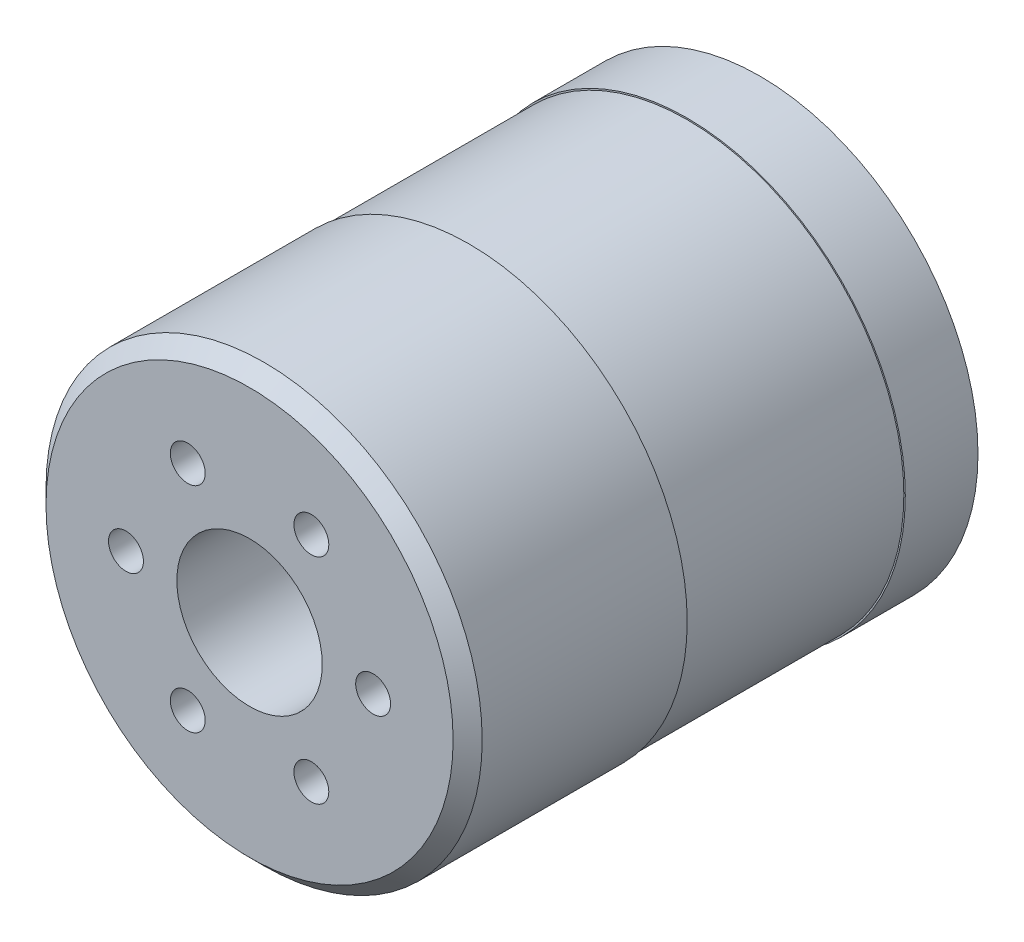
ISO-10303-21;
HEADER;
FILE_DESCRIPTION(('STEP AP214'),'2;1');
FILE_NAME('part.step','',(''),(''),'','','');
FILE_SCHEMA(('AUTOMOTIVE_DESIGN { 1 0 10303 214 1 1 1 1 }'));
ENDSEC;
DATA;
#1=APPLICATION_CONTEXT('core data for automotive mechanical design processes');
#2=APPLICATION_PROTOCOL_DEFINITION('international standard','automotive_design',2000,#1);
#3=PRODUCT_CONTEXT('',#1,'mechanical');
#4=PRODUCT('Part','Part','',(#3));
#5=PRODUCT_RELATED_PRODUCT_CATEGORY('part','',(#4));
#6=PRODUCT_DEFINITION_FORMATION('','',#4);
#7=PRODUCT_DEFINITION_CONTEXT('part definition',#1,'design');
#8=PRODUCT_DEFINITION('design','',#6,#7);
#9=PRODUCT_DEFINITION_SHAPE('','',#8);
#10=(LENGTH_UNIT() NAMED_UNIT(*) SI_UNIT(.MILLI.,.METRE.));
#11=(NAMED_UNIT(*) PLANE_ANGLE_UNIT() SI_UNIT($,.RADIAN.));
#12=(NAMED_UNIT(*) SI_UNIT($,.STERADIAN.) SOLID_ANGLE_UNIT());
#13=UNCERTAINTY_MEASURE_WITH_UNIT(LENGTH_MEASURE(1.E-05),#10,'distance_accuracy_value','');
#14=(GEOMETRIC_REPRESENTATION_CONTEXT(3) GLOBAL_UNCERTAINTY_ASSIGNED_CONTEXT((#13)) GLOBAL_UNIT_ASSIGNED_CONTEXT((#10,
#11,#12)) REPRESENTATION_CONTEXT('',''));
#15=CARTESIAN_POINT('',(0.,0.,0.));
#16=DIRECTION('',(0.,0.,1.));
#17=DIRECTION('',(1.,0.,0.));
#18=AXIS2_PLACEMENT_3D('',#15,#16,#17);
#19=CARTESIAN_POINT('',(0.,0.,0.));
#20=DIRECTION('',(0.,0.,1.));
#21=DIRECTION('',(1.,0.,0.));
#22=AXIS2_PLACEMENT_3D('',#19,#20,#21);
#23=PLANE('',#22);
#24=CARTESIAN_POINT('',(-13.,0.,0.));
#25=DIRECTION('',(0.,0.,-1.));
#26=DIRECTION('',(-1.,0.,0.));
#27=AXIS2_PLACEMENT_3D('',#24,#25,#26);
#28=CIRCLE('',#27,1.25);
#29=CARTESIAN_POINT('',(-14.25,0.,0.));
#30=VERTEX_POINT('',#29);
#31=EDGE_CURVE('E133',#30,#30,#28,.T.);
#32=ORIENTED_EDGE('',*,*,#31,.F.);
#33=EDGE_LOOP('',(#32));
#34=FACE_BOUND('',#33,.T.);
#35=CARTESIAN_POINT('',(0.,13.,0.));
#36=DIRECTION('',(0.,0.,-1.));
#37=DIRECTION('',(-1.,0.,0.));
#38=AXIS2_PLACEMENT_3D('',#35,#36,#37);
#39=CIRCLE('',#38,1.25);
#40=CARTESIAN_POINT('',(-1.25,13.,0.));
#41=VERTEX_POINT('',#40);
#42=EDGE_CURVE('E139',#41,#41,#39,.T.);
#43=ORIENTED_EDGE('',*,*,#42,.F.);
#44=EDGE_LOOP('',(#43));
#45=FACE_BOUND('',#44,.T.);
#46=CARTESIAN_POINT('',(13.,0.,0.));
#47=DIRECTION('',(0.,0.,-1.));
#48=DIRECTION('',(-1.,0.,0.));
#49=AXIS2_PLACEMENT_3D('',#46,#47,#48);
#50=CIRCLE('',#49,1.25);
#51=CARTESIAN_POINT('',(11.75,0.,0.));
#52=VERTEX_POINT('',#51);
#53=EDGE_CURVE('E145',#52,#52,#50,.T.);
#54=ORIENTED_EDGE('',*,*,#53,.F.);
#55=EDGE_LOOP('',(#54));
#56=FACE_BOUND('',#55,.T.);
#57=CARTESIAN_POINT('',(0.,-13.,0.));
#58=DIRECTION('',(0.,0.,-1.));
#59=DIRECTION('',(-1.,0.,0.));
#60=AXIS2_PLACEMENT_3D('',#57,#58,#59);
#61=CIRCLE('',#60,1.25);
#62=CARTESIAN_POINT('',(-1.25,-13.,0.));
#63=VERTEX_POINT('',#62);
#64=EDGE_CURVE('E151',#63,#63,#61,.T.);
#65=ORIENTED_EDGE('',*,*,#64,.F.);
#66=EDGE_LOOP('',(#65));
#67=FACE_BOUND('',#66,.T.);
#68=CARTESIAN_POINT('',(0.,0.,0.));
#69=DIRECTION('',(0.,0.,1.));
#70=DIRECTION('',(1.,0.,0.));
#71=AXIS2_PLACEMENT_3D('',#68,#69,#70);
#72=CIRCLE('',#71,9.);
#73=CARTESIAN_POINT('',(9.,0.,0.));
#74=VERTEX_POINT('',#73);
#75=EDGE_CURVE('E181',#74,#74,#72,.F.);
#76=ORIENTED_EDGE('',*,*,#75,.F.);
#77=EDGE_LOOP('',(#76));
#78=FACE_BOUND('',#77,.T.);
#79=CARTESIAN_POINT('',(0.,0.,0.));
#80=DIRECTION('',(0.,0.,-1.));
#81=DIRECTION('',(-1.,0.,0.));
#82=AXIS2_PLACEMENT_3D('',#79,#80,#81);
#83=CIRCLE('',#82,15.);
#84=CARTESIAN_POINT('',(-15.,0.,0.));
#85=VERTEX_POINT('',#84);
#86=EDGE_CURVE('E154',#85,#85,#83,.T.);
#87=ORIENTED_EDGE('',*,*,#86,.T.);
#88=EDGE_LOOP('',(#87));
#89=FACE_BOUND('',#88,.T.);
#90=ADVANCED_FACE('F39',(#34,#45,#56,#67,#78,#89),#23,.F.);
#91=CARTESIAN_POINT('',(0.,0.,-4.5));
#92=DIRECTION('',(0.,0.,-1.));
#93=DIRECTION('',(-1.,0.,0.));
#94=AXIS2_PLACEMENT_3D('',#91,#92,#93);
#95=PLANE('',#94);
#96=CARTESIAN_POINT('',(0.,0.,-4.5));
#97=DIRECTION('',(0.,0.,-1.));
#98=DIRECTION('',(-1.,0.,0.));
#99=AXIS2_PLACEMENT_3D('',#96,#97,#98);
#100=CIRCLE('',#99,5.);
#101=CARTESIAN_POINT('',(-5.,0.,-4.5));
#102=VERTEX_POINT('',#101);
#103=EDGE_CURVE('E173',#102,#102,#100,.T.);
#104=ORIENTED_EDGE('',*,*,#103,.T.);
#105=EDGE_LOOP('',(#104));
#106=FACE_BOUND('',#105,.T.);
#107=CARTESIAN_POINT('',(0.,0.,-4.5));
#108=DIRECTION('',(0.,0.,-1.));
#109=DIRECTION('',(-1.,0.,0.));
#110=AXIS2_PLACEMENT_3D('',#107,#108,#109);
#111=CIRCLE('',#110,4.);
#112=CARTESIAN_POINT('',(-4.,0.,-4.5));
#113=VERTEX_POINT('',#112);
#114=EDGE_CURVE('E169',#113,#113,#111,.T.);
#115=ORIENTED_EDGE('',*,*,#114,.F.);
#116=EDGE_LOOP('',(#115));
#117=FACE_BOUND('',#116,.T.);
#118=ADVANCED_FACE('F203',(#106,#117),#95,.T.);
#119=CARTESIAN_POINT('',(0.,0.,-4.));
#120=DIRECTION('',(0.,0.,-1.));
#121=DIRECTION('',(-1.,0.,0.));
#122=AXIS2_PLACEMENT_3D('',#119,#120,#121);
#123=PLANE('',#122);
#124=CARTESIAN_POINT('',(0.,0.,-4.));
#125=DIRECTION('',(0.,0.,-1.));
#126=DIRECTION('',(-1.,0.,0.));
#127=AXIS2_PLACEMENT_3D('',#124,#125,#126);
#128=CIRCLE('',#127,9.);
#129=CARTESIAN_POINT('',(-9.,0.,-4.));
#130=VERTEX_POINT('',#129);
#131=EDGE_CURVE('E176',#130,#130,#128,.T.);
#132=ORIENTED_EDGE('',*,*,#131,.T.);
#133=EDGE_LOOP('',(#132));
#134=FACE_BOUND('',#133,.T.);
#135=CARTESIAN_POINT('',(0.,0.,-4.));
#136=DIRECTION('',(0.,0.,-1.));
#137=DIRECTION('',(-1.,0.,0.));
#138=AXIS2_PLACEMENT_3D('',#135,#136,#137);
#139=CIRCLE('',#138,5.);
#140=CARTESIAN_POINT('',(-5.,0.,-4.));
#141=VERTEX_POINT('',#140);
#142=EDGE_CURVE('E172',#141,#141,#139,.T.);
#143=ORIENTED_EDGE('',*,*,#142,.F.);
#144=EDGE_LOOP('',(#143));
#145=FACE_BOUND('',#144,.T.);
#146=ADVANCED_FACE('F209',(#134,#145),#123,.T.);
#147=CARTESIAN_POINT('',(0.,0.,-4.));
#148=DIRECTION('',(0.,0.,1.));
#149=DIRECTION('',(1.,0.,0.));
#150=AXIS2_PLACEMENT_3D('',#147,#148,#149);
#151=CYLINDRICAL_SURFACE('',#150,9.);
#152=ORIENTED_EDGE('',*,*,#131,.F.);
#153=EDGE_LOOP('',(#152));
#154=FACE_BOUND('',#153,.T.);
#155=ORIENTED_EDGE('',*,*,#75,.T.);
#156=EDGE_LOOP('',(#155));
#157=FACE_BOUND('',#156,.T.);
#158=ADVANCED_FACE('F215',(#154,#157),#151,.T.);
#159=CARTESIAN_POINT('',(0.,0.,-4.5));
#160=DIRECTION('',(0.,0.,1.));
#161=DIRECTION('',(1.,0.,0.));
#162=AXIS2_PLACEMENT_3D('',#159,#160,#161);
#163=CYLINDRICAL_SURFACE('',#162,5.);
#164=ORIENTED_EDGE('',*,*,#103,.F.);
#165=EDGE_LOOP('',(#164));
#166=FACE_BOUND('',#165,.T.);
#167=ORIENTED_EDGE('',*,*,#142,.T.);
#168=EDGE_LOOP('',(#167));
#169=FACE_BOUND('',#168,.T.);
#170=ADVANCED_FACE('F218',(#166,#169),#163,.T.);
#171=CARTESIAN_POINT('',(0.,0.,-4.501));
#172=DIRECTION('',(0.,0.,1.));
#173=DIRECTION('',(1.,0.,0.));
#174=AXIS2_PLACEMENT_3D('',#171,#172,#173);
#175=CYLINDRICAL_SURFACE('',#174,4.);
#176=ORIENTED_EDGE('',*,*,#114,.T.);
#177=EDGE_LOOP('',(#176));
#178=FACE_BOUND('',#177,.T.);
#179=CARTESIAN_POINT('',(0.,0.,0.));
#180=DIRECTION('',(0.,0.,-1.));
#181=DIRECTION('',(-1.,0.,0.));
#182=AXIS2_PLACEMENT_3D('',#179,#180,#181);
#183=CIRCLE('',#182,4.);
#184=CARTESIAN_POINT('',(-4.,0.,0.));
#185=VERTEX_POINT('',#184);
#186=EDGE_CURVE('E166',#185,#185,#183,.T.);
#187=ORIENTED_EDGE('',*,*,#186,.F.);
#188=EDGE_LOOP('',(#187));
#189=FACE_BOUND('',#188,.T.);
#190=ADVANCED_FACE('F224',(#178,#189),#175,.F.);
#191=CARTESIAN_POINT('',(0.,0.,0.));
#192=DIRECTION('',(0.,0.,-1.));
#193=DIRECTION('',(-1.,0.,0.));
#194=AXIS2_PLACEMENT_3D('',#191,#192,#193);
#195=PLANE('',#194);
#196=ORIENTED_EDGE('',*,*,#186,.T.);
#197=EDGE_LOOP('',(#196));
#198=FACE_BOUND('',#197,.T.);
#199=ADVANCED_FACE('F229',(#198),#195,.T.);
#200=CARTESIAN_POINT('',(0.,0.,5.));
#201=DIRECTION('',(0.,0.,-1.));
#202=DIRECTION('',(-1.,0.,0.));
#203=AXIS2_PLACEMENT_3D('',#200,#201,#202);
#204=CYLINDRICAL_SURFACE('',#203,15.);
#205=CARTESIAN_POINT('',(0.,0.,5.));
#206=DIRECTION('',(0.,0.,-1.));
#207=DIRECTION('',(-1.,0.,0.));
#208=AXIS2_PLACEMENT_3D('',#205,#206,#207);
#209=CIRCLE('',#208,15.);
#210=CARTESIAN_POINT('',(-15.,0.,5.));
#211=VERTEX_POINT('',#210);
#212=EDGE_CURVE('E155',#211,#211,#209,.T.);
#213=ORIENTED_EDGE('',*,*,#212,.T.);
#214=EDGE_LOOP('',(#213));
#215=FACE_BOUND('',#214,.T.);
#216=ORIENTED_EDGE('',*,*,#86,.F.);
#217=EDGE_LOOP('',(#216));
#218=FACE_BOUND('',#217,.T.);
#219=ADVANCED_FACE('F233',(#215,#218),#204,.T.);
#220=CARTESIAN_POINT('',(0.,0.,5.));
#221=DIRECTION('',(0.,0.,-1.));
#222=DIRECTION('',(-1.,0.,0.));
#223=AXIS2_PLACEMENT_3D('',#220,#221,#222);
#224=PLANE('',#223);
#225=CARTESIAN_POINT('',(0.,0.,5.));
#226=DIRECTION('',(0.,0.,-1.));
#227=DIRECTION('',(-1.,0.,0.));
#228=AXIS2_PLACEMENT_3D('',#225,#226,#227);
#229=CIRCLE('',#228,14.9);
#230=CARTESIAN_POINT('',(-14.9,0.,5.));
#231=VERTEX_POINT('',#230);
#232=EDGE_CURVE('E43',#231,#231,#229,.F.);
#233=ORIENTED_EDGE('',*,*,#232,.F.);
#234=EDGE_LOOP('',(#233));
#235=FACE_BOUND('',#234,.T.);
#236=ORIENTED_EDGE('',*,*,#212,.F.);
#237=EDGE_LOOP('',(#236));
#238=FACE_BOUND('',#237,.T.);
#239=ADVANCED_FACE('F198',(#235,#238),#224,.F.);
#240=CARTESIAN_POINT('',(0.,0.,35.1));
#241=DIRECTION('',(0.,0.,1.));
#242=DIRECTION('',(1.,0.,0.));
#243=AXIS2_PLACEMENT_3D('',#240,#241,#242);
#244=PLANE('',#243);
#245=CARTESIAN_POINT('',(4.25000000000004,-7.36121593216771,35.1));
#246=DIRECTION('',(0.,0.,1.));
#247=DIRECTION('',(1.,0.,0.));
#248=AXIS2_PLACEMENT_3D('',#245,#246,#247);
#249=CIRCLE('',#248,1.19999999999999);
#250=CARTESIAN_POINT('',(5.45000000000003,-7.36121593216771,35.1));
#251=VERTEX_POINT('',#250);
#252=EDGE_CURVE('E90',#251,#251,#249,.T.);
#253=ORIENTED_EDGE('',*,*,#252,.F.);
#254=EDGE_LOOP('',(#253));
#255=FACE_BOUND('',#254,.T.);
#256=CARTESIAN_POINT('',(-4.24999999999998,-7.36121593216774,35.1));
#257=DIRECTION('',(0.,0.,1.));
#258=DIRECTION('',(1.,0.,0.));
#259=AXIS2_PLACEMENT_3D('',#256,#257,#258);
#260=CIRCLE('',#259,1.19999999999999);
#261=CARTESIAN_POINT('',(-3.04999999999999,-7.36121593216774,35.1));
#262=VERTEX_POINT('',#261);
#263=EDGE_CURVE('E89',#262,#262,#260,.T.);
#264=ORIENTED_EDGE('',*,*,#263,.F.);
#265=EDGE_LOOP('',(#264));
#266=FACE_BOUND('',#265,.T.);
#267=CARTESIAN_POINT('',(-8.5,0.,35.1));
#268=DIRECTION('',(0.,0.,1.));
#269=DIRECTION('',(1.,0.,0.));
#270=AXIS2_PLACEMENT_3D('',#267,#268,#269);
#271=CIRCLE('',#270,1.19999999999999);
#272=CARTESIAN_POINT('',(-7.30000000000001,0.,35.1));
#273=VERTEX_POINT('',#272);
#274=EDGE_CURVE('E100',#273,#273,#271,.T.);
#275=ORIENTED_EDGE('',*,*,#274,.F.);
#276=EDGE_LOOP('',(#275));
#277=FACE_BOUND('',#276,.T.);
#278=CARTESIAN_POINT('',(-4.25000000000004,7.36121593216771,35.1));
#279=DIRECTION('',(0.,0.,1.));
#280=DIRECTION('',(1.,0.,0.));
#281=AXIS2_PLACEMENT_3D('',#278,#279,#280);
#282=CIRCLE('',#281,1.19999999999999);
#283=CARTESIAN_POINT('',(-3.05000000000005,7.36121593216771,35.1));
#284=VERTEX_POINT('',#283);
#285=EDGE_CURVE('E106',#284,#284,#282,.T.);
#286=ORIENTED_EDGE('',*,*,#285,.F.);
#287=EDGE_LOOP('',(#286));
#288=FACE_BOUND('',#287,.T.);
#289=CARTESIAN_POINT('',(4.24999999999998,7.36121593216774,35.1));
#290=DIRECTION('',(0.,0.,1.));
#291=DIRECTION('',(1.,0.,0.));
#292=AXIS2_PLACEMENT_3D('',#289,#290,#291);
#293=CIRCLE('',#292,1.19999999999999);
#294=CARTESIAN_POINT('',(5.44999999999997,7.36121593216774,35.1));
#295=VERTEX_POINT('',#294);
#296=EDGE_CURVE('E112',#295,#295,#293,.T.);
#297=ORIENTED_EDGE('',*,*,#296,.F.);
#298=EDGE_LOOP('',(#297));
#299=FACE_BOUND('',#298,.T.);
#300=CARTESIAN_POINT('',(8.5,0.,35.1));
#301=DIRECTION('',(0.,0.,1.));
#302=DIRECTION('',(1.,0.,0.));
#303=AXIS2_PLACEMENT_3D('',#300,#301,#302);
#304=CIRCLE('',#303,1.19999999999999);
#305=CARTESIAN_POINT('',(9.69999999999999,0.,35.1));
#306=VERTEX_POINT('',#305);
#307=EDGE_CURVE('E118',#306,#306,#304,.T.);
#308=ORIENTED_EDGE('',*,*,#307,.F.);
#309=EDGE_LOOP('',(#308));
#310=FACE_BOUND('',#309,.T.);
#311=CARTESIAN_POINT('',(0.,0.,35.1));
#312=DIRECTION('',(0.,0.,1.));
#313=DIRECTION('',(1.,0.,0.));
#314=AXIS2_PLACEMENT_3D('',#311,#312,#313);
#315=CIRCLE('',#314,5.);
#316=CARTESIAN_POINT('',(5.,0.,35.1));
#317=VERTEX_POINT('',#316);
#318=EDGE_CURVE('E124',#317,#317,#315,.T.);
#319=ORIENTED_EDGE('',*,*,#318,.F.);
#320=EDGE_LOOP('',(#319));
#321=FACE_BOUND('',#320,.T.);
#322=CARTESIAN_POINT('',(0.,0.,35.1));
#323=DIRECTION('',(0.,0.,1.));
#324=DIRECTION('',(1.,0.,0.));
#325=AXIS2_PLACEMENT_3D('',#322,#323,#324);
#326=CIRCLE('',#325,14.);
#327=CARTESIAN_POINT('',(14.,0.,35.1));
#328=VERTEX_POINT('',#327);
#329=EDGE_CURVE('E48',#328,#328,#326,.T.);
#330=ORIENTED_EDGE('',*,*,#329,.T.);
#331=EDGE_LOOP('',(#330));
#332=FACE_BOUND('',#331,.T.);
#333=ADVANCED_FACE('F187',(#255,#266,#277,#288,#299,#310,#321,#332),#244,.T.);
#334=CARTESIAN_POINT('',(0.,0.,35.1));
#335=DIRECTION('',(0.,0.,-1.));
#336=DIRECTION('',(-1.,0.,0.));
#337=AXIS2_PLACEMENT_3D('',#334,#335,#336);
#338=CONICAL_SURFACE('',#337,14.,0.785398163397446);
#339=CARTESIAN_POINT('',(0.,0.,34.1));
#340=DIRECTION('',(0.,0.,1.));
#341=DIRECTION('',(1.,0.,0.));
#342=AXIS2_PLACEMENT_3D('',#339,#340,#341);
#343=CIRCLE('',#342,15.);
#344=CARTESIAN_POINT('',(15.,0.,34.1));
#345=VERTEX_POINT('',#344);
#346=EDGE_CURVE('E11',#345,#345,#343,.F.);
#347=ORIENTED_EDGE('',*,*,#346,.F.);
#348=EDGE_LOOP('',(#347));
#349=FACE_BOUND('',#348,.T.);
#350=ORIENTED_EDGE('',*,*,#329,.F.);
#351=EDGE_LOOP('',(#350));
#352=FACE_BOUND('',#351,.T.);
#353=ADVANCED_FACE('F41',(#349,#352),#338,.T.);
#354=CARTESIAN_POINT('',(0.,0.,35.1));
#355=DIRECTION('',(0.,0.,-1.));
#356=DIRECTION('',(-1.,0.,0.));
#357=AXIS2_PLACEMENT_3D('',#354,#355,#356);
#358=CYLINDRICAL_SURFACE('',#357,15.);
#359=ORIENTED_EDGE('',*,*,#346,.T.);
#360=EDGE_LOOP('',(#359));
#361=FACE_BOUND('',#360,.T.);
#362=CARTESIAN_POINT('',(0.,0.,20.));
#363=DIRECTION('',(0.,0.,-1.));
#364=DIRECTION('',(-1.,0.,0.));
#365=AXIS2_PLACEMENT_3D('',#362,#363,#364);
#366=CIRCLE('',#365,15.);
#367=CARTESIAN_POINT('',(-15.,0.,20.));
#368=VERTEX_POINT('',#367);
#369=EDGE_CURVE('E163',#368,#368,#366,.T.);
#370=ORIENTED_EDGE('',*,*,#369,.F.);
#371=EDGE_LOOP('',(#370));
#372=FACE_BOUND('',#371,.T.);
#373=ADVANCED_FACE('F190',(#361,#372),#358,.T.);
#374=CARTESIAN_POINT('',(0.,0.,20.));
#375=DIRECTION('',(0.,0.,-1.));
#376=DIRECTION('',(-1.,0.,0.));
#377=AXIS2_PLACEMENT_3D('',#374,#375,#376);
#378=PLANE('',#377);
#379=CARTESIAN_POINT('',(0.,0.,20.));
#380=DIRECTION('',(0.,0.,-1.));
#381=DIRECTION('',(-1.,0.,0.));
#382=AXIS2_PLACEMENT_3D('',#379,#380,#381);
#383=CIRCLE('',#382,14.9);
#384=CARTESIAN_POINT('',(-14.9,0.,20.));
#385=VERTEX_POINT('',#384);
#386=EDGE_CURVE('E160',#385,#385,#383,.T.);
#387=ORIENTED_EDGE('',*,*,#386,.F.);
#388=EDGE_LOOP('',(#387));
#389=FACE_BOUND('',#388,.T.);
#390=ORIENTED_EDGE('',*,*,#369,.T.);
#391=EDGE_LOOP('',(#390));
#392=FACE_BOUND('',#391,.T.);
#393=ADVANCED_FACE('F196',(#389,#392),#378,.T.);
#394=CARTESIAN_POINT('',(0.,0.,20.));
#395=DIRECTION('',(0.,0.,-1.));
#396=DIRECTION('',(-1.,0.,0.));
#397=AXIS2_PLACEMENT_3D('',#394,#395,#396);
#398=CYLINDRICAL_SURFACE('',#397,14.9);
#399=ORIENTED_EDGE('',*,*,#386,.T.);
#400=EDGE_LOOP('',(#399));
#401=FACE_BOUND('',#400,.T.);
#402=ORIENTED_EDGE('',*,*,#232,.T.);
#403=EDGE_LOOP('',(#402));
#404=FACE_BOUND('',#403,.T.);
#405=ADVANCED_FACE('F237',(#401,#404),#398,.T.);
#406=CARTESIAN_POINT('',(0.,-13.,0.));
#407=DIRECTION('',(0.,0.,-1.));
#408=DIRECTION('',(-1.,0.,0.));
#409=AXIS2_PLACEMENT_3D('',#406,#407,#408);
#410=CYLINDRICAL_SURFACE('',#409,1.25);
#411=CARTESIAN_POINT('',(0.,-13.,4.5));
#412=DIRECTION('',(0.,0.,-1.));
#413=DIRECTION('',(-1.,0.,0.));
#414=AXIS2_PLACEMENT_3D('',#411,#412,#413);
#415=CIRCLE('',#414,1.25);
#416=CARTESIAN_POINT('',(-1.25,-13.,4.5));
#417=VERTEX_POINT('',#416);
#418=EDGE_CURVE('E148',#417,#417,#415,.T.);
#419=ORIENTED_EDGE('',*,*,#418,.F.);
#420=EDGE_LOOP('',(#419));
#421=FACE_BOUND('',#420,.T.);
#422=ORIENTED_EDGE('',*,*,#64,.T.);
#423=EDGE_LOOP('',(#422));
#424=FACE_BOUND('',#423,.T.);
#425=ADVANCED_FACE('F241',(#421,#424),#410,.F.);
#426=CARTESIAN_POINT('',(0.,-13.,4.5));
#427=DIRECTION('',(0.,0.,-1.));
#428=DIRECTION('',(-1.,0.,0.));
#429=AXIS2_PLACEMENT_3D('',#426,#427,#428);
#430=CONICAL_SURFACE('',#429,1.25,1.02974425867665);
#431=CARTESIAN_POINT('',(0.,-13.,5.25107577378445));
#432=VERTEX_POINT('',#431);
#433=VERTEX_LOOP('',#432);
#434=FACE_BOUND('',#433,.T.);
#435=ORIENTED_EDGE('',*,*,#418,.T.);
#436=EDGE_LOOP('',(#435));
#437=FACE_BOUND('',#436,.T.);
#438=ADVANCED_FACE('F251',(#434,#437),#430,.F.);
#439=CARTESIAN_POINT('',(13.,0.,0.));
#440=DIRECTION('',(0.,0.,-1.));
#441=DIRECTION('',(-1.,0.,0.));
#442=AXIS2_PLACEMENT_3D('',#439,#440,#441);
#443=CYLINDRICAL_SURFACE('',#442,1.25);
#444=CARTESIAN_POINT('',(13.,0.,4.5));
#445=DIRECTION('',(0.,0.,-1.));
#446=DIRECTION('',(-1.,0.,0.));
#447=AXIS2_PLACEMENT_3D('',#444,#445,#446);
#448=CIRCLE('',#447,1.25);
#449=CARTESIAN_POINT('',(11.75,0.,4.5));
#450=VERTEX_POINT('',#449);
#451=EDGE_CURVE('E142',#450,#450,#448,.T.);
#452=ORIENTED_EDGE('',*,*,#451,.F.);
#453=EDGE_LOOP('',(#452));
#454=FACE_BOUND('',#453,.T.);
#455=ORIENTED_EDGE('',*,*,#53,.T.);
#456=EDGE_LOOP('',(#455));
#457=FACE_BOUND('',#456,.T.);
#458=ADVANCED_FACE('F255',(#454,#457),#443,.F.);
#459=CARTESIAN_POINT('',(13.,0.,4.5));
#460=DIRECTION('',(0.,0.,-1.));
#461=DIRECTION('',(-1.,0.,0.));
#462=AXIS2_PLACEMENT_3D('',#459,#460,#461);
#463=CONICAL_SURFACE('',#462,1.25,1.02974425867665);
#464=CARTESIAN_POINT('',(13.,0.,5.25107577378445));
#465=VERTEX_POINT('',#464);
#466=VERTEX_LOOP('',#465);
#467=FACE_BOUND('',#466,.T.);
#468=ORIENTED_EDGE('',*,*,#451,.T.);
#469=EDGE_LOOP('',(#468));
#470=FACE_BOUND('',#469,.T.);
#471=ADVANCED_FACE('F258',(#467,#470),#463,.F.);
#472=CARTESIAN_POINT('',(0.,13.,0.));
#473=DIRECTION('',(0.,0.,-1.));
#474=DIRECTION('',(-1.,0.,0.));
#475=AXIS2_PLACEMENT_3D('',#472,#473,#474);
#476=CYLINDRICAL_SURFACE('',#475,1.25);
#477=CARTESIAN_POINT('',(0.,13.,4.5));
#478=DIRECTION('',(0.,0.,-1.));
#479=DIRECTION('',(-1.,0.,0.));
#480=AXIS2_PLACEMENT_3D('',#477,#478,#479);
#481=CIRCLE('',#480,1.25);
#482=CARTESIAN_POINT('',(-1.25,13.,4.5));
#483=VERTEX_POINT('',#482);
#484=EDGE_CURVE('E136',#483,#483,#481,.T.);
#485=ORIENTED_EDGE('',*,*,#484,.F.);
#486=EDGE_LOOP('',(#485));
#487=FACE_BOUND('',#486,.T.);
#488=ORIENTED_EDGE('',*,*,#42,.T.);
#489=EDGE_LOOP('',(#488));
#490=FACE_BOUND('',#489,.T.);
#491=ADVANCED_FACE('F262',(#487,#490),#476,.F.);
#492=CARTESIAN_POINT('',(0.,13.,4.5));
#493=DIRECTION('',(0.,0.,-1.));
#494=DIRECTION('',(-1.,0.,0.));
#495=AXIS2_PLACEMENT_3D('',#492,#493,#494);
#496=CONICAL_SURFACE('',#495,1.25,1.02974425867665);
#497=CARTESIAN_POINT('',(0.,13.,5.25107577378445));
#498=VERTEX_POINT('',#497);
#499=VERTEX_LOOP('',#498);
#500=FACE_BOUND('',#499,.T.);
#501=ORIENTED_EDGE('',*,*,#484,.T.);
#502=EDGE_LOOP('',(#501));
#503=FACE_BOUND('',#502,.T.);
#504=ADVANCED_FACE('F265',(#500,#503),#496,.F.);
#505=CARTESIAN_POINT('',(-13.,0.,0.));
#506=DIRECTION('',(0.,0.,-1.));
#507=DIRECTION('',(-1.,0.,0.));
#508=AXIS2_PLACEMENT_3D('',#505,#506,#507);
#509=CYLINDRICAL_SURFACE('',#508,1.25);
#510=CARTESIAN_POINT('',(-13.,0.,4.5));
#511=DIRECTION('',(0.,0.,-1.));
#512=DIRECTION('',(-1.,0.,0.));
#513=AXIS2_PLACEMENT_3D('',#510,#511,#512);
#514=CIRCLE('',#513,1.25);
#515=CARTESIAN_POINT('',(-14.25,0.,4.5));
#516=VERTEX_POINT('',#515);
#517=EDGE_CURVE('E128',#516,#516,#514,.T.);
#518=ORIENTED_EDGE('',*,*,#517,.F.);
#519=EDGE_LOOP('',(#518));
#520=FACE_BOUND('',#519,.T.);
#521=ORIENTED_EDGE('',*,*,#31,.T.);
#522=EDGE_LOOP('',(#521));
#523=FACE_BOUND('',#522,.T.);
#524=ADVANCED_FACE('F269',(#520,#523),#509,.F.);
#525=CARTESIAN_POINT('',(-13.,0.,4.5));
#526=DIRECTION('',(0.,0.,-1.));
#527=DIRECTION('',(-1.,0.,0.));
#528=AXIS2_PLACEMENT_3D('',#525,#526,#527);
#529=CONICAL_SURFACE('',#528,1.25,1.02974425867665);
#530=CARTESIAN_POINT('',(-13.,0.,5.25107577378445));
#531=VERTEX_POINT('',#530);
#532=VERTEX_LOOP('',#531);
#533=FACE_BOUND('',#532,.T.);
#534=ORIENTED_EDGE('',*,*,#517,.T.);
#535=EDGE_LOOP('',(#534));
#536=FACE_BOUND('',#535,.T.);
#537=ADVANCED_FACE('F273',(#533,#536),#529,.F.);
#538=CARTESIAN_POINT('',(0.,0.,20.1));
#539=DIRECTION('',(0.,0.,1.));
#540=DIRECTION('',(1.,0.,0.));
#541=AXIS2_PLACEMENT_3D('',#538,#539,#540);
#542=CYLINDRICAL_SURFACE('',#541,5.);
#543=CARTESIAN_POINT('',(0.,0.,20.1));
#544=DIRECTION('',(0.,0.,1.));
#545=DIRECTION('',(1.,0.,0.));
#546=AXIS2_PLACEMENT_3D('',#543,#544,#545);
#547=CIRCLE('',#546,5.);
#548=CARTESIAN_POINT('',(5.,0.,20.1));
#549=VERTEX_POINT('',#548);
#550=EDGE_CURVE('E125',#549,#549,#547,.T.);
#551=ORIENTED_EDGE('',*,*,#550,.F.);
#552=EDGE_LOOP('',(#551));
#553=FACE_BOUND('',#552,.T.);
#554=ORIENTED_EDGE('',*,*,#318,.T.);
#555=EDGE_LOOP('',(#554));
#556=FACE_BOUND('',#555,.T.);
#557=ADVANCED_FACE('F277',(#553,#556),#542,.F.);
#558=CARTESIAN_POINT('',(0.,0.,20.1));
#559=DIRECTION('',(0.,0.,1.));
#560=DIRECTION('',(1.,0.,0.));
#561=AXIS2_PLACEMENT_3D('',#558,#559,#560);
#562=PLANE('',#561);
#563=ORIENTED_EDGE('',*,*,#550,.T.);
#564=EDGE_LOOP('',(#563));
#565=FACE_BOUND('',#564,.T.);
#566=ADVANCED_FACE('F281',(#565),#562,.T.);
#567=CARTESIAN_POINT('',(8.5,0.,32.1));
#568=DIRECTION('',(0.,0.,1.));
#569=DIRECTION('',(1.,0.,0.));
#570=AXIS2_PLACEMENT_3D('',#567,#568,#569);
#571=CONICAL_SURFACE('',#570,1.2,1.02974425867666);
#572=CARTESIAN_POINT('',(8.5,0.,31.3789672571669));
#573=VERTEX_POINT('',#572);
#574=VERTEX_LOOP('',#573);
#575=FACE_BOUND('',#574,.T.);
#576=CARTESIAN_POINT('',(8.5,0.,32.1));
#577=DIRECTION('',(0.,0.,1.));
#578=DIRECTION('',(1.,0.,0.));
#579=AXIS2_PLACEMENT_3D('',#576,#577,#578);
#580=CIRCLE('',#579,1.2);
#581=CARTESIAN_POINT('',(9.7,0.,32.1));
#582=VERTEX_POINT('',#581);
#583=EDGE_CURVE('E121',#582,#582,#580,.T.);
#584=ORIENTED_EDGE('',*,*,#583,.T.);
#585=EDGE_LOOP('',(#584));
#586=FACE_BOUND('',#585,.T.);
#587=ADVANCED_FACE('F285',(#575,#586),#571,.F.);
#588=CARTESIAN_POINT('',(8.5,0.,35.1));
#589=DIRECTION('',(0.,0.,1.));
#590=DIRECTION('',(1.,0.,0.));
#591=AXIS2_PLACEMENT_3D('',#588,#589,#590);
#592=CYLINDRICAL_SURFACE('',#591,1.19999999999999);
#593=ORIENTED_EDGE('',*,*,#583,.F.);
#594=EDGE_LOOP('',(#593));
#595=FACE_BOUND('',#594,.T.);
#596=ORIENTED_EDGE('',*,*,#307,.T.);
#597=EDGE_LOOP('',(#596));
#598=FACE_BOUND('',#597,.T.);
#599=ADVANCED_FACE('F289',(#595,#598),#592,.F.);
#600=CARTESIAN_POINT('',(4.24999999999998,7.36121593216774,32.1));
#601=DIRECTION('',(0.,0.,1.));
#602=DIRECTION('',(1.,0.,0.));
#603=AXIS2_PLACEMENT_3D('',#600,#601,#602);
#604=CONICAL_SURFACE('',#603,1.2,1.02974425867666);
#605=CARTESIAN_POINT('',(4.24999999999998,7.36121593216774,31.3789672571669));
#606=VERTEX_POINT('',#605);
#607=VERTEX_LOOP('',#606);
#608=FACE_BOUND('',#607,.T.);
#609=CARTESIAN_POINT('',(4.24999999999998,7.36121593216774,32.1));
#610=DIRECTION('',(0.,0.,1.));
#611=DIRECTION('',(1.,0.,0.));
#612=AXIS2_PLACEMENT_3D('',#609,#610,#611);
#613=CIRCLE('',#612,1.2);
#614=CARTESIAN_POINT('',(5.44999999999998,7.36121593216774,32.1));
#615=VERTEX_POINT('',#614);
#616=EDGE_CURVE('E115',#615,#615,#613,.T.);
#617=ORIENTED_EDGE('',*,*,#616,.T.);
#618=EDGE_LOOP('',(#617));
#619=FACE_BOUND('',#618,.T.);
#620=ADVANCED_FACE('F293',(#608,#619),#604,.F.);
#621=CARTESIAN_POINT('',(4.24999999999998,7.36121593216774,35.1));
#622=DIRECTION('',(0.,0.,1.));
#623=DIRECTION('',(1.,0.,0.));
#624=AXIS2_PLACEMENT_3D('',#621,#622,#623);
#625=CYLINDRICAL_SURFACE('',#624,1.19999999999999);
#626=ORIENTED_EDGE('',*,*,#616,.F.);
#627=EDGE_LOOP('',(#626));
#628=FACE_BOUND('',#627,.T.);
#629=ORIENTED_EDGE('',*,*,#296,.T.);
#630=EDGE_LOOP('',(#629));
#631=FACE_BOUND('',#630,.T.);
#632=ADVANCED_FACE('F297',(#628,#631),#625,.F.);
#633=CARTESIAN_POINT('',(-4.25000000000004,7.36121593216771,32.1));
#634=DIRECTION('',(0.,0.,1.));
#635=DIRECTION('',(1.,0.,0.));
#636=AXIS2_PLACEMENT_3D('',#633,#634,#635);
#637=CONICAL_SURFACE('',#636,1.2,1.02974425867666);
#638=CARTESIAN_POINT('',(-4.25000000000004,7.36121593216771,31.3789672571669));
#639=VERTEX_POINT('',#638);
#640=VERTEX_LOOP('',#639);
#641=FACE_BOUND('',#640,.T.);
#642=CARTESIAN_POINT('',(-4.25000000000004,7.36121593216771,32.1));
#643=DIRECTION('',(0.,0.,1.));
#644=DIRECTION('',(1.,0.,0.));
#645=AXIS2_PLACEMENT_3D('',#642,#643,#644);
#646=CIRCLE('',#645,1.2);
#647=CARTESIAN_POINT('',(-3.05000000000004,7.36121593216771,32.1));
#648=VERTEX_POINT('',#647);
#649=EDGE_CURVE('E109',#648,#648,#646,.T.);
#650=ORIENTED_EDGE('',*,*,#649,.T.);
#651=EDGE_LOOP('',(#650));
#652=FACE_BOUND('',#651,.T.);
#653=ADVANCED_FACE('F301',(#641,#652),#637,.F.);
#654=CARTESIAN_POINT('',(-4.25000000000004,7.36121593216771,35.1));
#655=DIRECTION('',(0.,0.,1.));
#656=DIRECTION('',(1.,0.,0.));
#657=AXIS2_PLACEMENT_3D('',#654,#655,#656);
#658=CYLINDRICAL_SURFACE('',#657,1.19999999999999);
#659=ORIENTED_EDGE('',*,*,#649,.F.);
#660=EDGE_LOOP('',(#659));
#661=FACE_BOUND('',#660,.T.);
#662=ORIENTED_EDGE('',*,*,#285,.T.);
#663=EDGE_LOOP('',(#662));
#664=FACE_BOUND('',#663,.T.);
#665=ADVANCED_FACE('F305',(#661,#664),#658,.F.);
#666=CARTESIAN_POINT('',(-8.5,0.,32.1));
#667=DIRECTION('',(0.,0.,1.));
#668=DIRECTION('',(1.,0.,0.));
#669=AXIS2_PLACEMENT_3D('',#666,#667,#668);
#670=CONICAL_SURFACE('',#669,1.2,1.02974425867666);
#671=CARTESIAN_POINT('',(-8.5,0.,31.3789672571669));
#672=VERTEX_POINT('',#671);
#673=VERTEX_LOOP('',#672);
#674=FACE_BOUND('',#673,.T.);
#675=CARTESIAN_POINT('',(-8.5,0.,32.1));
#676=DIRECTION('',(0.,0.,1.));
#677=DIRECTION('',(1.,0.,0.));
#678=AXIS2_PLACEMENT_3D('',#675,#676,#677);
#679=CIRCLE('',#678,1.2);
#680=CARTESIAN_POINT('',(-7.3,0.,32.1));
#681=VERTEX_POINT('',#680);
#682=EDGE_CURVE('E103',#681,#681,#679,.T.);
#683=ORIENTED_EDGE('',*,*,#682,.T.);
#684=EDGE_LOOP('',(#683));
#685=FACE_BOUND('',#684,.T.);
#686=ADVANCED_FACE('F309',(#674,#685),#670,.F.);
#687=CARTESIAN_POINT('',(-8.5,0.,35.1));
#688=DIRECTION('',(0.,0.,1.));
#689=DIRECTION('',(1.,0.,0.));
#690=AXIS2_PLACEMENT_3D('',#687,#688,#689);
#691=CYLINDRICAL_SURFACE('',#690,1.19999999999999);
#692=ORIENTED_EDGE('',*,*,#682,.F.);
#693=EDGE_LOOP('',(#692));
#694=FACE_BOUND('',#693,.T.);
#695=ORIENTED_EDGE('',*,*,#274,.T.);
#696=EDGE_LOOP('',(#695));
#697=FACE_BOUND('',#696,.T.);
#698=ADVANCED_FACE('F313',(#694,#697),#691,.F.);
#699=CARTESIAN_POINT('',(-4.24999999999998,-7.36121593216774,32.1));
#700=DIRECTION('',(0.,0.,1.));
#701=DIRECTION('',(1.,0.,0.));
#702=AXIS2_PLACEMENT_3D('',#699,#700,#701);
#703=CONICAL_SURFACE('',#702,1.2,1.02974425867666);
#704=CARTESIAN_POINT('',(-4.24999999999998,-7.36121593216774,31.3789672571669));
#705=VERTEX_POINT('',#704);
#706=VERTEX_LOOP('',#705);
#707=FACE_BOUND('',#706,.T.);
#708=CARTESIAN_POINT('',(-4.24999999999998,-7.36121593216774,32.1));
#709=DIRECTION('',(0.,0.,1.));
#710=DIRECTION('',(1.,0.,0.));
#711=AXIS2_PLACEMENT_3D('',#708,#709,#710);
#712=CIRCLE('',#711,1.2);
#713=CARTESIAN_POINT('',(-3.04999999999998,-7.36121593216774,32.1));
#714=VERTEX_POINT('',#713);
#715=EDGE_CURVE('E93',#714,#714,#712,.T.);
#716=ORIENTED_EDGE('',*,*,#715,.T.);
#717=EDGE_LOOP('',(#716));
#718=FACE_BOUND('',#717,.T.);
#719=ADVANCED_FACE('F317',(#707,#718),#703,.F.);
#720=CARTESIAN_POINT('',(-4.24999999999998,-7.36121593216774,35.1));
#721=DIRECTION('',(0.,0.,1.));
#722=DIRECTION('',(1.,0.,0.));
#723=AXIS2_PLACEMENT_3D('',#720,#721,#722);
#724=CYLINDRICAL_SURFACE('',#723,1.19999999999999);
#725=ORIENTED_EDGE('',*,*,#715,.F.);
#726=EDGE_LOOP('',(#725));
#727=FACE_BOUND('',#726,.T.);
#728=ORIENTED_EDGE('',*,*,#263,.T.);
#729=EDGE_LOOP('',(#728));
#730=FACE_BOUND('',#729,.T.);
#731=ADVANCED_FACE('F83',(#727,#730),#724,.F.);
#732=CARTESIAN_POINT('',(4.25000000000004,-7.36121593216771,32.1));
#733=DIRECTION('',(0.,0.,1.));
#734=DIRECTION('',(1.,0.,0.));
#735=AXIS2_PLACEMENT_3D('',#732,#733,#734);
#736=CONICAL_SURFACE('',#735,1.2,1.02974425867666);
#737=CARTESIAN_POINT('',(4.25000000000004,-7.36121593216771,31.3789672571669));
#738=VERTEX_POINT('',#737);
#739=VERTEX_LOOP('',#738);
#740=FACE_BOUND('',#739,.T.);
#741=CARTESIAN_POINT('',(4.25000000000004,-7.36121593216771,32.1));
#742=DIRECTION('',(0.,0.,1.));
#743=DIRECTION('',(1.,0.,0.));
#744=AXIS2_PLACEMENT_3D('',#741,#742,#743);
#745=CIRCLE('',#744,1.2);
#746=CARTESIAN_POINT('',(5.45000000000004,-7.36121593216771,32.1));
#747=VERTEX_POINT('',#746);
#748=EDGE_CURVE('E87',#747,#747,#745,.T.);
#749=ORIENTED_EDGE('',*,*,#748,.T.);
#750=EDGE_LOOP('',(#749));
#751=FACE_BOUND('',#750,.T.);
#752=ADVANCED_FACE('F79',(#740,#751),#736,.F.);
#753=CARTESIAN_POINT('',(4.25000000000004,-7.36121593216771,35.1));
#754=DIRECTION('',(0.,0.,1.));
#755=DIRECTION('',(1.,0.,0.));
#756=AXIS2_PLACEMENT_3D('',#753,#754,#755);
#757=CYLINDRICAL_SURFACE('',#756,1.19999999999999);
#758=ORIENTED_EDGE('',*,*,#748,.F.);
#759=EDGE_LOOP('',(#758));
#760=FACE_BOUND('',#759,.T.);
#761=ORIENTED_EDGE('',*,*,#252,.T.);
#762=EDGE_LOOP('',(#761));
#763=FACE_BOUND('',#762,.T.);
#764=ADVANCED_FACE('F82',(#760,#763),#757,.F.);
#765=CLOSED_SHELL('',(#90,#118,#146,#158,#170,#190,#199,#219,#239,#333,#353,#373,#393,#405,#425,
#438,#458,#471,#491,#504,#524,#537,#557,#566,#587,#599,#620,#632,#653,#665,#686,#698,#719,#731,
#752,#764));
#766=MANIFOLD_SOLID_BREP('B2',#765);
#767=ADVANCED_BREP_SHAPE_REPRESENTATION('',(#18,#766),#14);
#768=SHAPE_DEFINITION_REPRESENTATION(#9,#767);
ENDSEC;
END-ISO-10303-21;
